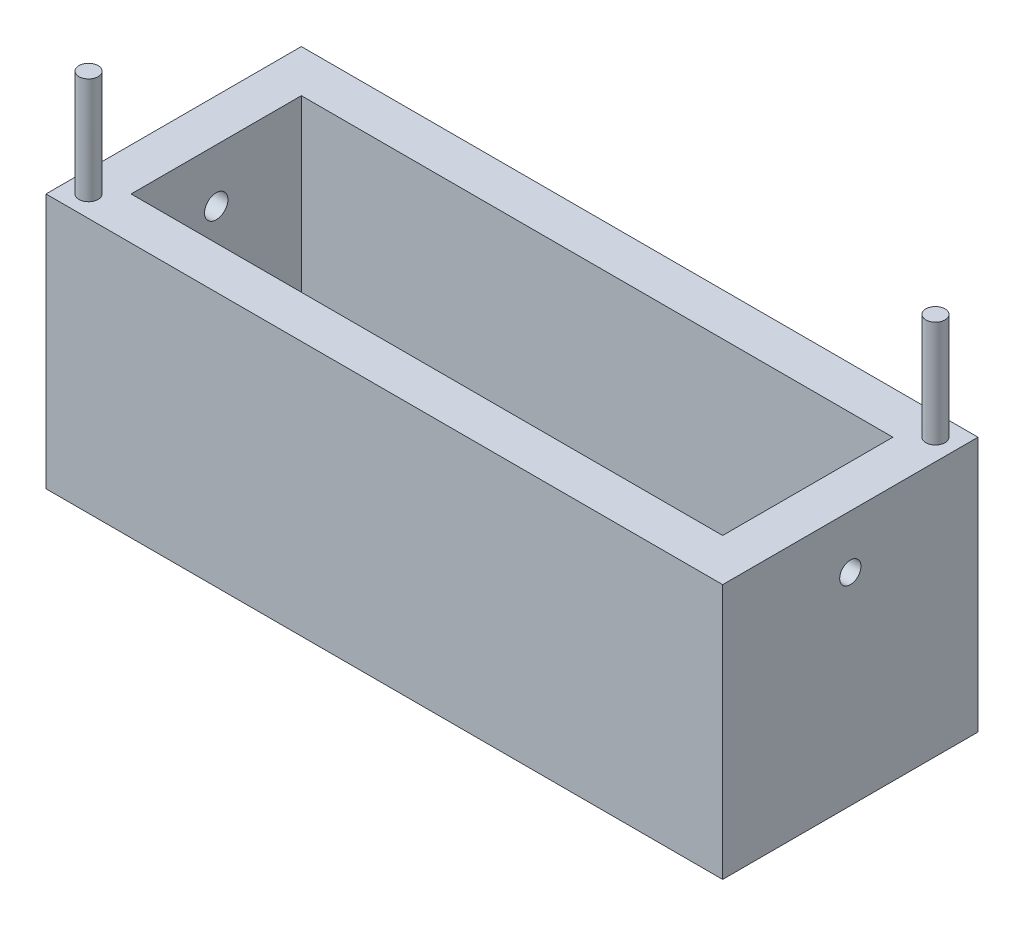
ISO-10303-21;
HEADER;
FILE_DESCRIPTION(('STEP AP214'),'2;1');
FILE_NAME('part.step','',(''),(''),'','','');
FILE_SCHEMA(('AUTOMOTIVE_DESIGN { 1 0 10303 214 1 1 1 1 }'));
ENDSEC;
DATA;
#1=APPLICATION_CONTEXT('core data for automotive mechanical design processes');
#2=APPLICATION_PROTOCOL_DEFINITION('international standard','automotive_design',2000,#1);
#3=PRODUCT_CONTEXT('',#1,'mechanical');
#4=PRODUCT('Part','Part','',(#3));
#5=PRODUCT_RELATED_PRODUCT_CATEGORY('part','',(#4));
#6=PRODUCT_DEFINITION_FORMATION('','',#4);
#7=PRODUCT_DEFINITION_CONTEXT('part definition',#1,'design');
#8=PRODUCT_DEFINITION('design','',#6,#7);
#9=PRODUCT_DEFINITION_SHAPE('','',#8);
#10=(LENGTH_UNIT() NAMED_UNIT(*) SI_UNIT(.MILLI.,.METRE.));
#11=(NAMED_UNIT(*) PLANE_ANGLE_UNIT() SI_UNIT($,.RADIAN.));
#12=(NAMED_UNIT(*) SI_UNIT($,.STERADIAN.) SOLID_ANGLE_UNIT());
#13=UNCERTAINTY_MEASURE_WITH_UNIT(LENGTH_MEASURE(1.E-05),#10,'distance_accuracy_value','');
#14=(GEOMETRIC_REPRESENTATION_CONTEXT(3) GLOBAL_UNCERTAINTY_ASSIGNED_CONTEXT((#13)) GLOBAL_UNIT_ASSIGNED_CONTEXT((#10,
#11,#12)) REPRESENTATION_CONTEXT('',''));
#15=CARTESIAN_POINT('',(0.,0.,0.));
#16=DIRECTION('',(0.,0.,1.));
#17=DIRECTION('',(1.,0.,0.));
#18=AXIS2_PLACEMENT_3D('',#15,#16,#17);
#19=CARTESIAN_POINT('',(0.,152.4,0.));
#20=DIRECTION('',(1.,0.,0.));
#21=DIRECTION('',(0.,0.,-1.));
#22=AXIS2_PLACEMENT_3D('',#19,#20,#21);
#23=PLANE('',#22);
#24=CARTESIAN_POINT('',(0.,120.65,-76.2));
#25=DIRECTION('',(-1.,0.,0.));
#26=DIRECTION('',(0.,0.,1.));
#27=AXIS2_PLACEMENT_3D('',#24,#25,#26);
#28=CIRCLE('',#27,6.98500000000001);
#29=CARTESIAN_POINT('',(0.,120.65,-69.215));
#30=VERTEX_POINT('',#29);
#31=EDGE_CURVE('E186',#30,#30,#28,.T.);
#32=ORIENTED_EDGE('',*,*,#31,.F.);
#33=EDGE_LOOP('',(#32));
#34=FACE_BOUND('',#33,.T.);
#35=DIRECTION('',(0.,0.,1.));
#36=VECTOR('',#35,1.);
#37=CARTESIAN_POINT('',(0.,0.,0.));
#38=LINE('',#37,#36);
#39=CARTESIAN_POINT('',(0.,0.,-152.4));
#40=VERTEX_POINT('',#39);
#41=CARTESIAN_POINT('',(0.,0.,0.));
#42=VERTEX_POINT('',#41);
#43=EDGE_CURVE('E147',#40,#42,#38,.T.);
#44=ORIENTED_EDGE('',*,*,#43,.T.);
#45=DIRECTION('',(0.,-1.,0.));
#46=VECTOR('',#45,1.);
#47=CARTESIAN_POINT('',(0.,152.4,0.));
#48=LINE('',#47,#46);
#49=CARTESIAN_POINT('',(0.,152.4,0.));
#50=VERTEX_POINT('',#49);
#51=EDGE_CURVE('E171',#50,#42,#48,.T.);
#52=ORIENTED_EDGE('',*,*,#51,.F.);
#53=DIRECTION('',(0.,0.,1.));
#54=VECTOR('',#53,1.);
#55=CARTESIAN_POINT('',(0.,152.4,0.));
#56=LINE('',#55,#54);
#57=CARTESIAN_POINT('',(0.,152.4,-152.4));
#58=VERTEX_POINT('',#57);
#59=EDGE_CURVE('E151',#58,#50,#56,.T.);
#60=ORIENTED_EDGE('',*,*,#59,.F.);
#61=DIRECTION('',(0.,-1.,0.));
#62=VECTOR('',#61,1.);
#63=CARTESIAN_POINT('',(0.,152.4,-152.4));
#64=LINE('',#63,#62);
#65=EDGE_CURVE('E157',#58,#40,#64,.T.);
#66=ORIENTED_EDGE('',*,*,#65,.T.);
#67=EDGE_LOOP('',(#44,#52,#60,#66));
#68=FACE_BOUND('',#67,.T.);
#69=ADVANCED_FACE('F33',(#34,#68),#23,.F.);
#70=CARTESIAN_POINT('',(0.,152.4,0.));
#71=DIRECTION('',(0.,0.,-1.));
#72=DIRECTION('',(-1.,0.,0.));
#73=AXIS2_PLACEMENT_3D('',#70,#71,#72);
#74=PLANE('',#73);
#75=DIRECTION('',(1.,0.,0.));
#76=VECTOR('',#75,1.);
#77=CARTESIAN_POINT('',(0.,0.,0.));
#78=LINE('',#77,#76);
#79=CARTESIAN_POINT('',(403.86,0.,0.));
#80=VERTEX_POINT('',#79);
#81=EDGE_CURVE('E160',#42,#80,#78,.T.);
#82=ORIENTED_EDGE('',*,*,#81,.T.);
#83=DIRECTION('',(0.,-1.,0.));
#84=VECTOR('',#83,1.);
#85=CARTESIAN_POINT('',(403.86,152.4,0.));
#86=LINE('',#85,#84);
#87=CARTESIAN_POINT('',(403.86,152.4,0.));
#88=VERTEX_POINT('',#87);
#89=EDGE_CURVE('E168',#88,#80,#86,.T.);
#90=ORIENTED_EDGE('',*,*,#89,.F.);
#91=DIRECTION('',(1.,0.,0.));
#92=VECTOR('',#91,1.);
#93=CARTESIAN_POINT('',(0.,152.4,0.));
#94=LINE('',#93,#92);
#95=EDGE_CURVE('E87',#50,#88,#94,.T.);
#96=ORIENTED_EDGE('',*,*,#95,.F.);
#97=ORIENTED_EDGE('',*,*,#51,.T.);
#98=EDGE_LOOP('',(#82,#90,#96,#97));
#99=FACE_BOUND('',#98,.T.);
#100=ADVANCED_FACE('F196',(#99),#74,.F.);
#101=CARTESIAN_POINT('',(403.86,152.4,0.));
#102=DIRECTION('',(-1.,0.,0.));
#103=DIRECTION('',(0.,0.,1.));
#104=AXIS2_PLACEMENT_3D('',#101,#102,#103);
#105=PLANE('',#104);
#106=CARTESIAN_POINT('',(403.86,120.65,-76.2));
#107=DIRECTION('',(1.,0.,0.));
#108=DIRECTION('',(0.,0.,-1.));
#109=AXIS2_PLACEMENT_3D('',#106,#107,#108);
#110=CIRCLE('',#109,6.34999999999999);
#111=CARTESIAN_POINT('',(403.86,120.65,-82.55));
#112=VERTEX_POINT('',#111);
#113=EDGE_CURVE('E177',#112,#112,#110,.T.);
#114=ORIENTED_EDGE('',*,*,#113,.F.);
#115=EDGE_LOOP('',(#114));
#116=FACE_BOUND('',#115,.T.);
#117=DIRECTION('',(0.,0.,-1.));
#118=VECTOR('',#117,1.);
#119=CARTESIAN_POINT('',(403.86,0.,0.));
#120=LINE('',#119,#118);
#121=CARTESIAN_POINT('',(403.86,0.,-152.4));
#122=VERTEX_POINT('',#121);
#123=EDGE_CURVE('E162',#80,#122,#120,.T.);
#124=ORIENTED_EDGE('',*,*,#123,.T.);
#125=DIRECTION('',(0.,-1.,0.));
#126=VECTOR('',#125,1.);
#127=CARTESIAN_POINT('',(403.86,152.4,-152.4));
#128=LINE('',#127,#126);
#129=CARTESIAN_POINT('',(403.86,152.4,-152.4));
#130=VERTEX_POINT('',#129);
#131=EDGE_CURVE('E166',#130,#122,#128,.T.);
#132=ORIENTED_EDGE('',*,*,#131,.F.);
#133=DIRECTION('',(0.,0.,-1.));
#134=VECTOR('',#133,1.);
#135=CARTESIAN_POINT('',(403.86,152.4,0.));
#136=LINE('',#135,#134);
#137=EDGE_CURVE('E154',#88,#130,#136,.T.);
#138=ORIENTED_EDGE('',*,*,#137,.F.);
#139=ORIENTED_EDGE('',*,*,#89,.T.);
#140=EDGE_LOOP('',(#124,#132,#138,#139));
#141=FACE_BOUND('',#140,.T.);
#142=ADVANCED_FACE('F204',(#116,#141),#105,.F.);
#143=CARTESIAN_POINT('',(0.,152.4,-152.4));
#144=DIRECTION('',(0.,0.,1.));
#145=DIRECTION('',(1.,0.,0.));
#146=AXIS2_PLACEMENT_3D('',#143,#144,#145);
#147=PLANE('',#146);
#148=DIRECTION('',(-1.,0.,0.));
#149=VECTOR('',#148,1.);
#150=CARTESIAN_POINT('',(0.,0.,-152.4));
#151=LINE('',#150,#149);
#152=EDGE_CURVE('E79',#122,#40,#151,.T.);
#153=ORIENTED_EDGE('',*,*,#152,.T.);
#154=ORIENTED_EDGE('',*,*,#65,.F.);
#155=DIRECTION('',(-1.,0.,0.));
#156=VECTOR('',#155,1.);
#157=CARTESIAN_POINT('',(0.,152.4,-152.4));
#158=LINE('',#157,#156);
#159=EDGE_CURVE('E58',#130,#58,#158,.T.);
#160=ORIENTED_EDGE('',*,*,#159,.F.);
#161=ORIENTED_EDGE('',*,*,#131,.T.);
#162=EDGE_LOOP('',(#153,#154,#160,#161));
#163=FACE_BOUND('',#162,.T.);
#164=ADVANCED_FACE('F208',(#163),#147,.F.);
#165=CARTESIAN_POINT('',(0.,152.4,0.));
#166=DIRECTION('',(0.,-1.,0.));
#167=DIRECTION('',(0.,0.,-1.));
#168=AXIS2_PLACEMENT_3D('',#165,#166,#167);
#169=PLANE('',#168);
#170=CARTESIAN_POINT('',(391.16,152.4,-139.7));
#171=DIRECTION('',(0.,-1.,0.));
#172=DIRECTION('',(0.,0.,-1.));
#173=AXIS2_PLACEMENT_3D('',#170,#171,#172);
#174=CIRCLE('',#173,5.71500000000004);
#175=CARTESIAN_POINT('',(391.16,152.4,-145.415));
#176=VERTEX_POINT('',#175);
#177=EDGE_CURVE('E11',#176,#176,#174,.F.);
#178=ORIENTED_EDGE('',*,*,#177,.F.);
#179=EDGE_LOOP('',(#178));
#180=FACE_BOUND('',#179,.T.);
#181=CARTESIAN_POINT('',(12.7,152.4,-12.7));
#182=DIRECTION('',(0.,-1.,0.));
#183=DIRECTION('',(0.,0.,-1.));
#184=AXIS2_PLACEMENT_3D('',#181,#182,#183);
#185=CIRCLE('',#184,5.715);
#186=CARTESIAN_POINT('',(12.7,152.4,-18.415));
#187=VERTEX_POINT('',#186);
#188=EDGE_CURVE('E41',#187,#187,#185,.F.);
#189=ORIENTED_EDGE('',*,*,#188,.F.);
#190=EDGE_LOOP('',(#189));
#191=FACE_BOUND('',#190,.T.);
#192=DIRECTION('',(1.,0.,0.));
#193=VECTOR('',#192,1.);
#194=CARTESIAN_POINT('',(25.4,152.4,-25.4));
#195=LINE('',#194,#193);
#196=CARTESIAN_POINT('',(25.4,152.4,-25.4));
#197=VERTEX_POINT('',#196);
#198=CARTESIAN_POINT('',(378.46,152.4,-25.4));
#199=VERTEX_POINT('',#198);
#200=EDGE_CURVE('E141',#197,#199,#195,.T.);
#201=ORIENTED_EDGE('',*,*,#200,.F.);
#202=DIRECTION('',(0.,0.,1.));
#203=VECTOR('',#202,1.);
#204=CARTESIAN_POINT('',(25.4,152.4,-127.));
#205=LINE('',#204,#203);
#206=CARTESIAN_POINT('',(25.4,152.4,-127.));
#207=VERTEX_POINT('',#206);
#208=EDGE_CURVE('E49',#207,#197,#205,.T.);
#209=ORIENTED_EDGE('',*,*,#208,.F.);
#210=DIRECTION('',(-1.,0.,0.));
#211=VECTOR('',#210,1.);
#212=CARTESIAN_POINT('',(25.4,152.4,-127.));
#213=LINE('',#212,#211);
#214=CARTESIAN_POINT('',(378.46,152.4,-127.));
#215=VERTEX_POINT('',#214);
#216=EDGE_CURVE('E129',#215,#207,#213,.T.);
#217=ORIENTED_EDGE('',*,*,#216,.F.);
#218=DIRECTION('',(0.,0.,-1.));
#219=VECTOR('',#218,1.);
#220=CARTESIAN_POINT('',(378.46,152.4,-127.));
#221=LINE('',#220,#219);
#222=EDGE_CURVE('E132',#199,#215,#221,.T.);
#223=ORIENTED_EDGE('',*,*,#222,.F.);
#224=EDGE_LOOP('',(#201,#209,#217,#223));
#225=FACE_BOUND('',#224,.T.);
#226=ORIENTED_EDGE('',*,*,#59,.T.);
#227=ORIENTED_EDGE('',*,*,#95,.T.);
#228=ORIENTED_EDGE('',*,*,#137,.T.);
#229=ORIENTED_EDGE('',*,*,#159,.T.);
#230=EDGE_LOOP('',(#226,#227,#228,#229));
#231=FACE_BOUND('',#230,.T.);
#232=ADVANCED_FACE('F214',(#180,#191,#225,#231),#169,.F.);
#233=CARTESIAN_POINT('',(0.,0.,0.));
#234=DIRECTION('',(0.,-1.,0.));
#235=DIRECTION('',(0.,0.,-1.));
#236=AXIS2_PLACEMENT_3D('',#233,#234,#235);
#237=PLANE('',#236);
#238=ORIENTED_EDGE('',*,*,#43,.F.);
#239=ORIENTED_EDGE('',*,*,#152,.F.);
#240=ORIENTED_EDGE('',*,*,#123,.F.);
#241=ORIENTED_EDGE('',*,*,#81,.F.);
#242=EDGE_LOOP('',(#238,#239,#240,#241));
#243=FACE_BOUND('',#242,.T.);
#244=ADVANCED_FACE('F201',(#243),#237,.T.);
#245=CARTESIAN_POINT('',(25.4,12.7000000000001,-127.));
#246=DIRECTION('',(-1.,0.,0.));
#247=DIRECTION('',(0.,0.,1.));
#248=AXIS2_PLACEMENT_3D('',#245,#246,#247);
#249=PLANE('',#248);
#250=CARTESIAN_POINT('',(25.4,120.65,-76.2));
#251=DIRECTION('',(-1.,0.,0.));
#252=DIRECTION('',(0.,0.,1.));
#253=AXIS2_PLACEMENT_3D('',#250,#251,#252);
#254=CIRCLE('',#253,6.98500000000001);
#255=CARTESIAN_POINT('',(25.4,120.65,-69.215));
#256=VERTEX_POINT('',#255);
#257=EDGE_CURVE('E36',#256,#256,#254,.T.);
#258=ORIENTED_EDGE('',*,*,#257,.T.);
#259=EDGE_LOOP('',(#258));
#260=FACE_BOUND('',#259,.T.);
#261=ORIENTED_EDGE('',*,*,#208,.T.);
#262=DIRECTION('',(0.,1.,0.));
#263=VECTOR('',#262,1.);
#264=CARTESIAN_POINT('',(25.4,12.7000000000001,-25.4));
#265=LINE('',#264,#263);
#266=CARTESIAN_POINT('',(25.4,12.7000000000001,-25.4));
#267=VERTEX_POINT('',#266);
#268=EDGE_CURVE('E107',#267,#197,#265,.T.);
#269=ORIENTED_EDGE('',*,*,#268,.F.);
#270=DIRECTION('',(0.,0.,1.));
#271=VECTOR('',#270,1.);
#272=CARTESIAN_POINT('',(25.4,12.7000000000001,-127.));
#273=LINE('',#272,#271);
#274=CARTESIAN_POINT('',(25.4,12.7000000000001,-127.));
#275=VERTEX_POINT('',#274);
#276=EDGE_CURVE('E111',#275,#267,#273,.T.);
#277=ORIENTED_EDGE('',*,*,#276,.F.);
#278=DIRECTION('',(0.,1.,0.));
#279=VECTOR('',#278,1.);
#280=CARTESIAN_POINT('',(25.4,12.7000000000001,-127.));
#281=LINE('',#280,#279);
#282=EDGE_CURVE('E145',#275,#207,#281,.T.);
#283=ORIENTED_EDGE('',*,*,#282,.T.);
#284=EDGE_LOOP('',(#261,#269,#277,#283));
#285=FACE_BOUND('',#284,.T.);
#286=ADVANCED_FACE('F109',(#260,#285),#249,.F.);
#287=CARTESIAN_POINT('',(25.4,12.7000000000001,-127.));
#288=DIRECTION('',(0.,0.,-1.));
#289=DIRECTION('',(-1.,0.,0.));
#290=AXIS2_PLACEMENT_3D('',#287,#288,#289);
#291=PLANE('',#290);
#292=ORIENTED_EDGE('',*,*,#216,.T.);
#293=ORIENTED_EDGE('',*,*,#282,.F.);
#294=DIRECTION('',(-1.,0.,0.));
#295=VECTOR('',#294,1.);
#296=CARTESIAN_POINT('',(25.4,12.7000000000001,-127.));
#297=LINE('',#296,#295);
#298=CARTESIAN_POINT('',(378.46,12.7000000000001,-127.));
#299=VERTEX_POINT('',#298);
#300=EDGE_CURVE('E117',#299,#275,#297,.T.);
#301=ORIENTED_EDGE('',*,*,#300,.F.);
#302=DIRECTION('',(0.,1.,0.));
#303=VECTOR('',#302,1.);
#304=CARTESIAN_POINT('',(378.46,12.7000000000001,-127.));
#305=LINE('',#304,#303);
#306=EDGE_CURVE('E148',#299,#215,#305,.T.);
#307=ORIENTED_EDGE('',*,*,#306,.T.);
#308=EDGE_LOOP('',(#292,#293,#301,#307));
#309=FACE_BOUND('',#308,.T.);
#310=ADVANCED_FACE('F222',(#309),#291,.F.);
#311=CARTESIAN_POINT('',(378.46,12.7000000000001,-127.));
#312=DIRECTION('',(1.,0.,0.));
#313=DIRECTION('',(0.,0.,-1.));
#314=AXIS2_PLACEMENT_3D('',#311,#312,#313);
#315=PLANE('',#314);
#316=CARTESIAN_POINT('',(378.46,120.65,-76.2));
#317=DIRECTION('',(1.,0.,0.));
#318=DIRECTION('',(0.,0.,-1.));
#319=AXIS2_PLACEMENT_3D('',#316,#317,#318);
#320=CIRCLE('',#319,6.34999999999999);
#321=CARTESIAN_POINT('',(378.46,120.65,-82.55));
#322=VERTEX_POINT('',#321);
#323=EDGE_CURVE('E174',#322,#322,#320,.T.);
#324=ORIENTED_EDGE('',*,*,#323,.T.);
#325=EDGE_LOOP('',(#324));
#326=FACE_BOUND('',#325,.T.);
#327=ORIENTED_EDGE('',*,*,#222,.T.);
#328=ORIENTED_EDGE('',*,*,#306,.F.);
#329=DIRECTION('',(0.,0.,-1.));
#330=VECTOR('',#329,1.);
#331=CARTESIAN_POINT('',(378.46,12.7000000000001,-127.));
#332=LINE('',#331,#330);
#333=CARTESIAN_POINT('',(378.46,12.7000000000001,-25.4));
#334=VERTEX_POINT('',#333);
#335=EDGE_CURVE('E125',#334,#299,#332,.T.);
#336=ORIENTED_EDGE('',*,*,#335,.F.);
#337=DIRECTION('',(0.,1.,0.));
#338=VECTOR('',#337,1.);
#339=CARTESIAN_POINT('',(378.46,12.7000000000001,-25.4));
#340=LINE('',#339,#338);
#341=EDGE_CURVE('E116',#334,#199,#340,.T.);
#342=ORIENTED_EDGE('',*,*,#341,.T.);
#343=EDGE_LOOP('',(#327,#328,#336,#342));
#344=FACE_BOUND('',#343,.T.);
#345=ADVANCED_FACE('F226',(#326,#344),#315,.F.);
#346=CARTESIAN_POINT('',(25.4,12.7000000000001,-25.4));
#347=DIRECTION('',(0.,0.,1.));
#348=DIRECTION('',(1.,0.,0.));
#349=AXIS2_PLACEMENT_3D('',#346,#347,#348);
#350=PLANE('',#349);
#351=ORIENTED_EDGE('',*,*,#200,.T.);
#352=ORIENTED_EDGE('',*,*,#341,.F.);
#353=DIRECTION('',(1.,0.,0.));
#354=VECTOR('',#353,1.);
#355=CARTESIAN_POINT('',(25.4,12.7000000000001,-25.4));
#356=LINE('',#355,#354);
#357=EDGE_CURVE('E120',#267,#334,#356,.T.);
#358=ORIENTED_EDGE('',*,*,#357,.F.);
#359=ORIENTED_EDGE('',*,*,#268,.T.);
#360=EDGE_LOOP('',(#351,#352,#358,#359));
#361=FACE_BOUND('',#360,.T.);
#362=ADVANCED_FACE('F121',(#361),#350,.F.);
#363=CARTESIAN_POINT('',(0.,12.7000000000001,0.));
#364=DIRECTION('',(0.,1.,0.));
#365=DIRECTION('',(0.,0.,1.));
#366=AXIS2_PLACEMENT_3D('',#363,#364,#365);
#367=PLANE('',#366);
#368=ORIENTED_EDGE('',*,*,#276,.T.);
#369=ORIENTED_EDGE('',*,*,#357,.T.);
#370=ORIENTED_EDGE('',*,*,#335,.T.);
#371=ORIENTED_EDGE('',*,*,#300,.T.);
#372=EDGE_LOOP('',(#368,#369,#370,#371));
#373=FACE_BOUND('',#372,.T.);
#374=ADVANCED_FACE('F127',(#373),#367,.T.);
#375=CARTESIAN_POINT('',(12.7,215.9,-12.7));
#376=DIRECTION('',(0.,-1.,0.));
#377=DIRECTION('',(0.,0.,-1.));
#378=AXIS2_PLACEMENT_3D('',#375,#376,#377);
#379=CYLINDRICAL_SURFACE('',#378,5.715);
#380=CARTESIAN_POINT('',(12.7,215.9,-12.7));
#381=DIRECTION('',(0.,1.,0.));
#382=DIRECTION('',(0.,0.,1.));
#383=AXIS2_PLACEMENT_3D('',#380,#381,#382);
#384=CIRCLE('',#383,5.715);
#385=CARTESIAN_POINT('',(12.7,215.9,-6.98500000000002));
#386=VERTEX_POINT('',#385);
#387=EDGE_CURVE('E135',#386,#386,#384,.T.);
#388=ORIENTED_EDGE('',*,*,#387,.F.);
#389=EDGE_LOOP('',(#388));
#390=FACE_BOUND('',#389,.T.);
#391=ORIENTED_EDGE('',*,*,#188,.T.);
#392=EDGE_LOOP('',(#391));
#393=FACE_BOUND('',#392,.T.);
#394=ADVANCED_FACE('F234',(#390,#393),#379,.T.);
#395=CARTESIAN_POINT('',(12.7,215.9,-12.7));
#396=DIRECTION('',(0.,1.,0.));
#397=DIRECTION('',(0.,0.,1.));
#398=AXIS2_PLACEMENT_3D('',#395,#396,#397);
#399=PLANE('',#398);
#400=ORIENTED_EDGE('',*,*,#387,.T.);
#401=EDGE_LOOP('',(#400));
#402=FACE_BOUND('',#401,.T.);
#403=ADVANCED_FACE('F237',(#402),#399,.T.);
#404=CARTESIAN_POINT('',(391.16,215.9,-139.7));
#405=DIRECTION('',(0.,-1.,0.));
#406=DIRECTION('',(0.,0.,-1.));
#407=AXIS2_PLACEMENT_3D('',#404,#405,#406);
#408=CYLINDRICAL_SURFACE('',#407,5.71500000000004);
#409=CARTESIAN_POINT('',(391.16,215.9,-139.7));
#410=DIRECTION('',(0.,1.,0.));
#411=DIRECTION('',(0.,0.,1.));
#412=AXIS2_PLACEMENT_3D('',#409,#410,#411);
#413=CIRCLE('',#412,5.71500000000004);
#414=CARTESIAN_POINT('',(391.16,215.9,-133.985));
#415=VERTEX_POINT('',#414);
#416=EDGE_CURVE('E176',#415,#415,#413,.T.);
#417=ORIENTED_EDGE('',*,*,#416,.F.);
#418=EDGE_LOOP('',(#417));
#419=FACE_BOUND('',#418,.T.);
#420=ORIENTED_EDGE('',*,*,#177,.T.);
#421=EDGE_LOOP('',(#420));
#422=FACE_BOUND('',#421,.T.);
#423=ADVANCED_FACE('F241',(#419,#422),#408,.T.);
#424=CARTESIAN_POINT('',(391.16,215.9,-139.7));
#425=DIRECTION('',(0.,1.,0.));
#426=DIRECTION('',(0.,0.,1.));
#427=AXIS2_PLACEMENT_3D('',#424,#425,#426);
#428=PLANE('',#427);
#429=ORIENTED_EDGE('',*,*,#416,.T.);
#430=EDGE_LOOP('',(#429));
#431=FACE_BOUND('',#430,.T.);
#432=ADVANCED_FACE('F245',(#431),#428,.T.);
#433=CARTESIAN_POINT('',(340.36,120.65,-76.2));
#434=DIRECTION('',(1.,0.,0.));
#435=DIRECTION('',(0.,0.,-1.));
#436=AXIS2_PLACEMENT_3D('',#433,#434,#435);
#437=CYLINDRICAL_SURFACE('',#436,6.34999999999999);
#438=ORIENTED_EDGE('',*,*,#113,.T.);
#439=EDGE_LOOP('',(#438));
#440=FACE_BOUND('',#439,.T.);
#441=ORIENTED_EDGE('',*,*,#323,.F.);
#442=EDGE_LOOP('',(#441));
#443=FACE_BOUND('',#442,.T.);
#444=ADVANCED_FACE('F249',(#440,#443),#437,.F.);
#445=CARTESIAN_POINT('',(63.5,120.65,-76.2));
#446=DIRECTION('',(-1.,0.,0.));
#447=DIRECTION('',(0.,0.,1.));
#448=AXIS2_PLACEMENT_3D('',#445,#446,#447);
#449=CYLINDRICAL_SURFACE('',#448,6.98500000000001);
#450=ORIENTED_EDGE('',*,*,#31,.T.);
#451=EDGE_LOOP('',(#450));
#452=FACE_BOUND('',#451,.T.);
#453=ORIENTED_EDGE('',*,*,#257,.F.);
#454=EDGE_LOOP('',(#453));
#455=FACE_BOUND('',#454,.T.);
#456=ADVANCED_FACE('F191',(#452,#455),#449,.F.);
#457=CLOSED_SHELL('',(#69,#100,#142,#164,#232,#244,#286,#310,#345,#362,#374,#394,#403,#423,#432,
#444,#456));
#458=MANIFOLD_SOLID_BREP('B2',#457);
#459=ADVANCED_BREP_SHAPE_REPRESENTATION('',(#18,#458),#14);
#460=SHAPE_DEFINITION_REPRESENTATION(#9,#459);
ENDSEC;
END-ISO-10303-21;
